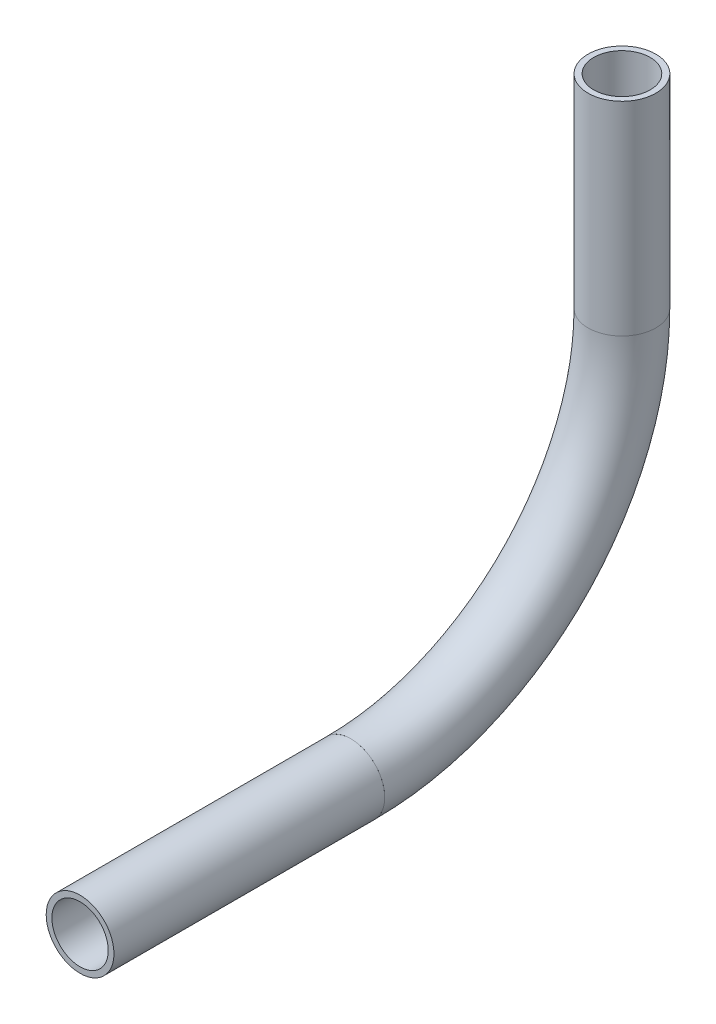
ISO-10303-21;
HEADER;
FILE_DESCRIPTION(('STEP AP214'),'2;1');
FILE_NAME('part.step','',(''),(''),'','','');
FILE_SCHEMA(('AUTOMOTIVE_DESIGN { 1 0 10303 214 1 1 1 1 }'));
ENDSEC;
DATA;
#1=APPLICATION_CONTEXT('core data for automotive mechanical design processes');
#2=APPLICATION_PROTOCOL_DEFINITION('international standard','automotive_design',2000,#1);
#3=PRODUCT_CONTEXT('',#1,'mechanical');
#4=PRODUCT('Part','Part','',(#3));
#5=PRODUCT_RELATED_PRODUCT_CATEGORY('part','',(#4));
#6=PRODUCT_DEFINITION_FORMATION('','',#4);
#7=PRODUCT_DEFINITION_CONTEXT('part definition',#1,'design');
#8=PRODUCT_DEFINITION('design','',#6,#7);
#9=PRODUCT_DEFINITION_SHAPE('','',#8);
#10=(LENGTH_UNIT() NAMED_UNIT(*) SI_UNIT(.MILLI.,.METRE.));
#11=(NAMED_UNIT(*) PLANE_ANGLE_UNIT() SI_UNIT($,.RADIAN.));
#12=(NAMED_UNIT(*) SI_UNIT($,.STERADIAN.) SOLID_ANGLE_UNIT());
#13=UNCERTAINTY_MEASURE_WITH_UNIT(LENGTH_MEASURE(1.E-05),#10,'distance_accuracy_value','');
#14=(GEOMETRIC_REPRESENTATION_CONTEXT(3) GLOBAL_UNCERTAINTY_ASSIGNED_CONTEXT((#13)) GLOBAL_UNIT_ASSIGNED_CONTEXT((#10,
#11,#12)) REPRESENTATION_CONTEXT('',''));
#15=CARTESIAN_POINT('',(0.,0.,0.));
#16=DIRECTION('',(0.,0.,1.));
#17=DIRECTION('',(1.,0.,0.));
#18=AXIS2_PLACEMENT_3D('',#15,#16,#17);
#19=CARTESIAN_POINT('',(0.,-225.780467918474,259.179579455468));
#20=DIRECTION('',(0.,1.,0.));
#21=DIRECTION('',(0.,0.,1.));
#22=AXIS2_PLACEMENT_3D('',#19,#20,#21);
#23=CYLINDRICAL_SURFACE('',#22,5.28319999999999);
#24=CARTESIAN_POINT('',(0.,-187.680467918475,259.179579455468));
#25=DIRECTION('',(0.,-1.,0.));
#26=DIRECTION('',(0.,0.,-1.));
#27=AXIS2_PLACEMENT_3D('',#24,#25,#26);
#28=CIRCLE('',#27,5.28319999999999);
#29=CARTESIAN_POINT('',(0.,-187.680467918475,253.896379455468));
#30=VERTEX_POINT('',#29);
#31=EDGE_CURVE('E58',#30,#30,#28,.T.);
#32=ORIENTED_EDGE('',*,*,#31,.F.);
#33=EDGE_LOOP('',(#32));
#34=FACE_BOUND('',#33,.T.);
#35=CARTESIAN_POINT('',(0.,-225.780467918474,259.179579455468));
#36=DIRECTION('',(0.,-1.,0.));
#37=DIRECTION('',(0.,0.,-1.));
#38=AXIS2_PLACEMENT_3D('',#35,#36,#37);
#39=CIRCLE('',#38,5.28319999999999);
#40=CARTESIAN_POINT('',(0.,-225.780467918474,253.896379455468));
#41=VERTEX_POINT('',#40);
#42=EDGE_CURVE('E54',#41,#41,#39,.T.);
#43=ORIENTED_EDGE('',*,*,#42,.T.);
#44=EDGE_LOOP('',(#43));
#45=FACE_BOUND('',#44,.T.);
#46=ADVANCED_FACE('F50',(#34,#45),#23,.F.);
#47=CARTESIAN_POINT('',(0.,-225.780467918474,259.179579455468));
#48=DIRECTION('',(0.,1.,0.));
#49=DIRECTION('',(0.,0.,1.));
#50=AXIS2_PLACEMENT_3D('',#47,#48,#49);
#51=CYLINDRICAL_SURFACE('',#50,6.35);
#52=CARTESIAN_POINT('',(0.,-187.680467918475,259.179579455468));
#53=DIRECTION('',(0.,-1.,0.));
#54=DIRECTION('',(0.,0.,-1.));
#55=AXIS2_PLACEMENT_3D('',#52,#53,#54);
#56=CIRCLE('',#55,6.35);
#57=CARTESIAN_POINT('',(0.,-187.680467918475,252.829579455468));
#58=VERTEX_POINT('',#57);
#59=EDGE_CURVE('E62',#58,#58,#56,.T.);
#60=ORIENTED_EDGE('',*,*,#59,.T.);
#61=EDGE_LOOP('',(#60));
#62=FACE_BOUND('',#61,.T.);
#63=CARTESIAN_POINT('',(0.,-225.780467918474,259.179579455468));
#64=DIRECTION('',(0.,-1.,0.));
#65=DIRECTION('',(0.,0.,-1.));
#66=AXIS2_PLACEMENT_3D('',#63,#64,#65);
#67=CIRCLE('',#66,6.35);
#68=CARTESIAN_POINT('',(0.,-225.780467918474,252.829579455468));
#69=VERTEX_POINT('',#68);
#70=EDGE_CURVE('E12',#69,#69,#67,.T.);
#71=ORIENTED_EDGE('',*,*,#70,.F.);
#72=EDGE_LOOP('',(#71));
#73=FACE_BOUND('',#72,.T.);
#74=ADVANCED_FACE('F77',(#62,#73),#51,.T.);
#75=CARTESIAN_POINT('',(0.,-187.680467918475,259.179579455468));
#76=DIRECTION('',(0.,-1.,0.));
#77=DIRECTION('',(0.,0.,-1.));
#78=AXIS2_PLACEMENT_3D('',#75,#76,#77);
#79=PLANE('',#78);
#80=ORIENTED_EDGE('',*,*,#31,.T.);
#81=EDGE_LOOP('',(#80));
#82=FACE_BOUND('',#81,.T.);
#83=ORIENTED_EDGE('',*,*,#59,.F.);
#84=EDGE_LOOP('',(#83));
#85=FACE_BOUND('',#84,.T.);
#86=ADVANCED_FACE('F73',(#82,#85),#79,.F.);
#87=CARTESIAN_POINT('',(0.,-225.780467918474,259.179579455468));
#88=DIRECTION('',(0.,-1.,0.));
#89=DIRECTION('',(0.,0.,-1.));
#90=AXIS2_PLACEMENT_3D('',#87,#88,#89);
#91=PLANE('',#90);
#92=ORIENTED_EDGE('',*,*,#42,.F.);
#93=EDGE_LOOP('',(#92));
#94=FACE_BOUND('',#93,.T.);
#95=ORIENTED_EDGE('',*,*,#70,.T.);
#96=EDGE_LOOP('',(#95));
#97=FACE_BOUND('',#96,.T.);
#98=ADVANCED_FACE('F52',(#94,#97),#91,.T.);
#99=CLOSED_SHELL('',(#46,#74,#86,#98));
#100=MANIFOLD_SOLID_BREP('B2',#99);
#101=CARTESIAN_POINT('',(0.,-225.780467918474,309.979579455468));
#102=DIRECTION('',(1.,0.,0.));
#103=DIRECTION('',(0.,0.,-1.));
#104=AXIS2_PLACEMENT_3D('',#101,#102,#103);
#105=TOROIDAL_SURFACE('',#104,50.8,5.28319999999999);
#106=CARTESIAN_POINT('',(0.,-276.580467918474,309.979579455468));
#107=DIRECTION('',(0.,0.,1.));
#108=DIRECTION('',(0.,-1.,0.));
#109=AXIS2_PLACEMENT_3D('',#106,#107,#108);
#110=CIRCLE('',#109,5.28319999999999);
#111=CARTESIAN_POINT('',(0.,-281.863667918474,309.979579455468));
#112=VERTEX_POINT('',#111);
#113=EDGE_CURVE('E155',#112,#112,#110,.T.);
#114=CARTESIAN_POINT('',(0.,-225.780467918474,259.179579455468));
#115=DIRECTION('',(0.,1.,0.));
#116=DIRECTION('',(0.,0.,1.));
#117=AXIS2_PLACEMENT_3D('',#114,#115,#116);
#118=CIRCLE('',#117,5.28319999999999);
#119=CARTESIAN_POINT('',(0.,-225.780467918474,253.896379455468));
#120=VERTEX_POINT('',#119);
#121=EDGE_CURVE('E145',#120,#120,#118,.T.);
#122=CARTESIAN_POINT('',(0.,-225.780467918474,309.979579455468));
#123=DIRECTION('',(1.,0.,0.));
#124=DIRECTION('',(0.,0.,-1.));
#125=AXIS2_PLACEMENT_3D('',#122,#123,#124);
#126=CIRCLE('',#125,56.0831999999999);
#127=EDGE_CURVE('',#112,#120,#126,.T.);
#128=ORIENTED_EDGE('',*,*,#113,.T.);
#129=ORIENTED_EDGE('',*,*,#121,.T.);
#130=ORIENTED_EDGE('',*,*,#127,.T.);
#131=ORIENTED_EDGE('',*,*,#127,.F.);
#132=EDGE_LOOP('',(#128,#130,#129,#131));
#133=FACE_BOUND('',#132,.T.);
#134=ADVANCED_FACE('F141',(#133),#105,.F.);
#135=CARTESIAN_POINT('',(0.,-225.780467918474,309.979579455468));
#136=DIRECTION('',(1.,0.,0.));
#137=DIRECTION('',(0.,0.,-1.));
#138=AXIS2_PLACEMENT_3D('',#135,#136,#137);
#139=TOROIDAL_SURFACE('',#138,50.8,6.35);
#140=CARTESIAN_POINT('',(0.,-276.580467918474,309.979579455468));
#141=DIRECTION('',(0.,0.,1.));
#142=DIRECTION('',(0.,-1.,0.));
#143=AXIS2_PLACEMENT_3D('',#140,#141,#142);
#144=CIRCLE('',#143,6.35);
#145=CARTESIAN_POINT('',(0.,-282.930467918474,309.979579455468));
#146=VERTEX_POINT('',#145);
#147=EDGE_CURVE('E149',#146,#146,#144,.T.);
#148=CARTESIAN_POINT('',(0.,-225.780467918474,259.179579455468));
#149=DIRECTION('',(0.,1.,0.));
#150=DIRECTION('',(0.,0.,1.));
#151=AXIS2_PLACEMENT_3D('',#148,#149,#150);
#152=CIRCLE('',#151,6.35);
#153=CARTESIAN_POINT('',(0.,-225.780467918474,252.829579455468));
#154=VERTEX_POINT('',#153);
#155=EDGE_CURVE('E49',#154,#154,#152,.T.);
#156=CARTESIAN_POINT('',(0.,-225.780467918474,309.979579455468));
#157=DIRECTION('',(1.,0.,0.));
#158=DIRECTION('',(0.,0.,-1.));
#159=AXIS2_PLACEMENT_3D('',#156,#157,#158);
#160=CIRCLE('',#159,57.1499999999999);
#161=EDGE_CURVE('',#146,#154,#160,.T.);
#162=ORIENTED_EDGE('',*,*,#147,.F.);
#163=ORIENTED_EDGE('',*,*,#155,.F.);
#164=ORIENTED_EDGE('',*,*,#161,.T.);
#165=ORIENTED_EDGE('',*,*,#161,.F.);
#166=EDGE_LOOP('',(#162,#164,#163,#165));
#167=FACE_BOUND('',#166,.T.);
#168=ADVANCED_FACE('F168',(#167),#139,.T.);
#169=CARTESIAN_POINT('',(0.,-276.580467918475,309.979579455468));
#170=DIRECTION('',(0.,0.,1.));
#171=DIRECTION('',(0.,-1.,0.));
#172=AXIS2_PLACEMENT_3D('',#169,#170,#171);
#173=PLANE('',#172);
#174=ORIENTED_EDGE('',*,*,#113,.F.);
#175=EDGE_LOOP('',(#174));
#176=FACE_BOUND('',#175,.T.);
#177=ORIENTED_EDGE('',*,*,#147,.T.);
#178=EDGE_LOOP('',(#177));
#179=FACE_BOUND('',#178,.T.);
#180=ADVANCED_FACE('F164',(#176,#179),#173,.T.);
#181=CARTESIAN_POINT('',(0.,-225.780467918474,259.179579455468));
#182=DIRECTION('',(0.,1.,0.));
#183=DIRECTION('',(0.,0.,1.));
#184=AXIS2_PLACEMENT_3D('',#181,#182,#183);
#185=PLANE('',#184);
#186=ORIENTED_EDGE('',*,*,#121,.F.);
#187=EDGE_LOOP('',(#186));
#188=FACE_BOUND('',#187,.T.);
#189=ORIENTED_EDGE('',*,*,#155,.T.);
#190=EDGE_LOOP('',(#189));
#191=FACE_BOUND('',#190,.T.);
#192=ADVANCED_FACE('F143',(#188,#191),#185,.T.);
#193=CLOSED_SHELL('',(#134,#168,#180,#192));
#194=MANIFOLD_SOLID_BREP('B7',#193);
#195=CARTESIAN_POINT('',(0.,-276.580467918475,360.727648374792));
#196=DIRECTION('',(0.,0.,-1.));
#197=DIRECTION('',(0.,1.,0.));
#198=AXIS2_PLACEMENT_3D('',#195,#196,#197);
#199=CYLINDRICAL_SURFACE('',#198,5.28319999999999);
#200=CARTESIAN_POINT('',(0.,-276.580467918475,360.727648374792));
#201=DIRECTION('',(0.,0.,1.));
#202=DIRECTION('',(0.,-1.,0.));
#203=AXIS2_PLACEMENT_3D('',#200,#201,#202);
#204=CIRCLE('',#203,5.28319999999999);
#205=CARTESIAN_POINT('',(0.,-281.863667918475,360.727648374792));
#206=VERTEX_POINT('',#205);
#207=EDGE_CURVE('E245',#206,#206,#204,.T.);
#208=ORIENTED_EDGE('',*,*,#207,.T.);
#209=EDGE_LOOP('',(#208));
#210=FACE_BOUND('',#209,.T.);
#211=CARTESIAN_POINT('',(0.,-276.580467918475,309.979579455468));
#212=DIRECTION('',(0.,0.,-1.));
#213=DIRECTION('',(0.,1.,0.));
#214=AXIS2_PLACEMENT_3D('',#211,#212,#213);
#215=CIRCLE('',#214,5.28319999999999);
#216=CARTESIAN_POINT('',(0.,-271.297267918475,309.979579455468));
#217=VERTEX_POINT('',#216);
#218=EDGE_CURVE('E235',#217,#217,#215,.T.);
#219=ORIENTED_EDGE('',*,*,#218,.T.);
#220=EDGE_LOOP('',(#219));
#221=FACE_BOUND('',#220,.T.);
#222=ADVANCED_FACE('F231',(#210,#221),#199,.F.);
#223=CARTESIAN_POINT('',(0.,-276.580467918475,360.727648374792));
#224=DIRECTION('',(0.,0.,-1.));
#225=DIRECTION('',(0.,1.,0.));
#226=AXIS2_PLACEMENT_3D('',#223,#224,#225);
#227=CYLINDRICAL_SURFACE('',#226,6.35);
#228=CARTESIAN_POINT('',(0.,-276.580467918475,360.727648374792));
#229=DIRECTION('',(0.,0.,1.));
#230=DIRECTION('',(0.,-1.,0.));
#231=AXIS2_PLACEMENT_3D('',#228,#229,#230);
#232=CIRCLE('',#231,6.35);
#233=CARTESIAN_POINT('',(0.,-282.930467918475,360.727648374792));
#234=VERTEX_POINT('',#233);
#235=EDGE_CURVE('E239',#234,#234,#232,.T.);
#236=ORIENTED_EDGE('',*,*,#235,.F.);
#237=EDGE_LOOP('',(#236));
#238=FACE_BOUND('',#237,.T.);
#239=CARTESIAN_POINT('',(0.,-276.580467918475,309.979579455468));
#240=DIRECTION('',(0.,0.,-1.));
#241=DIRECTION('',(0.,1.,0.));
#242=AXIS2_PLACEMENT_3D('',#239,#240,#241);
#243=CIRCLE('',#242,6.35);
#244=CARTESIAN_POINT('',(0.,-270.230467918475,309.979579455468));
#245=VERTEX_POINT('',#244);
#246=EDGE_CURVE('E140',#245,#245,#243,.T.);
#247=ORIENTED_EDGE('',*,*,#246,.F.);
#248=EDGE_LOOP('',(#247));
#249=FACE_BOUND('',#248,.T.);
#250=ADVANCED_FACE('F258',(#238,#249),#227,.T.);
#251=CARTESIAN_POINT('',(0.,-276.580467918475,360.727648374792));
#252=DIRECTION('',(0.,0.,1.));
#253=DIRECTION('',(0.,-1.,0.));
#254=AXIS2_PLACEMENT_3D('',#251,#252,#253);
#255=PLANE('',#254);
#256=ORIENTED_EDGE('',*,*,#207,.F.);
#257=EDGE_LOOP('',(#256));
#258=FACE_BOUND('',#257,.T.);
#259=ORIENTED_EDGE('',*,*,#235,.T.);
#260=EDGE_LOOP('',(#259));
#261=FACE_BOUND('',#260,.T.);
#262=ADVANCED_FACE('F254',(#258,#261),#255,.T.);
#263=CARTESIAN_POINT('',(0.,-276.580467918475,309.979579455468));
#264=DIRECTION('',(0.,0.,-1.));
#265=DIRECTION('',(0.,1.,0.));
#266=AXIS2_PLACEMENT_3D('',#263,#264,#265);
#267=PLANE('',#266);
#268=ORIENTED_EDGE('',*,*,#218,.F.);
#269=EDGE_LOOP('',(#268));
#270=FACE_BOUND('',#269,.T.);
#271=ORIENTED_EDGE('',*,*,#246,.T.);
#272=EDGE_LOOP('',(#271));
#273=FACE_BOUND('',#272,.T.);
#274=ADVANCED_FACE('F233',(#270,#273),#267,.T.);
#275=CLOSED_SHELL('',(#222,#250,#262,#274));
#276=MANIFOLD_SOLID_BREP('B44',#275);
#277=ADVANCED_BREP_SHAPE_REPRESENTATION('',(#18,#100,#194,#276),#14);
#278=SHAPE_DEFINITION_REPRESENTATION(#9,#277);
ENDSEC;
END-ISO-10303-21;
